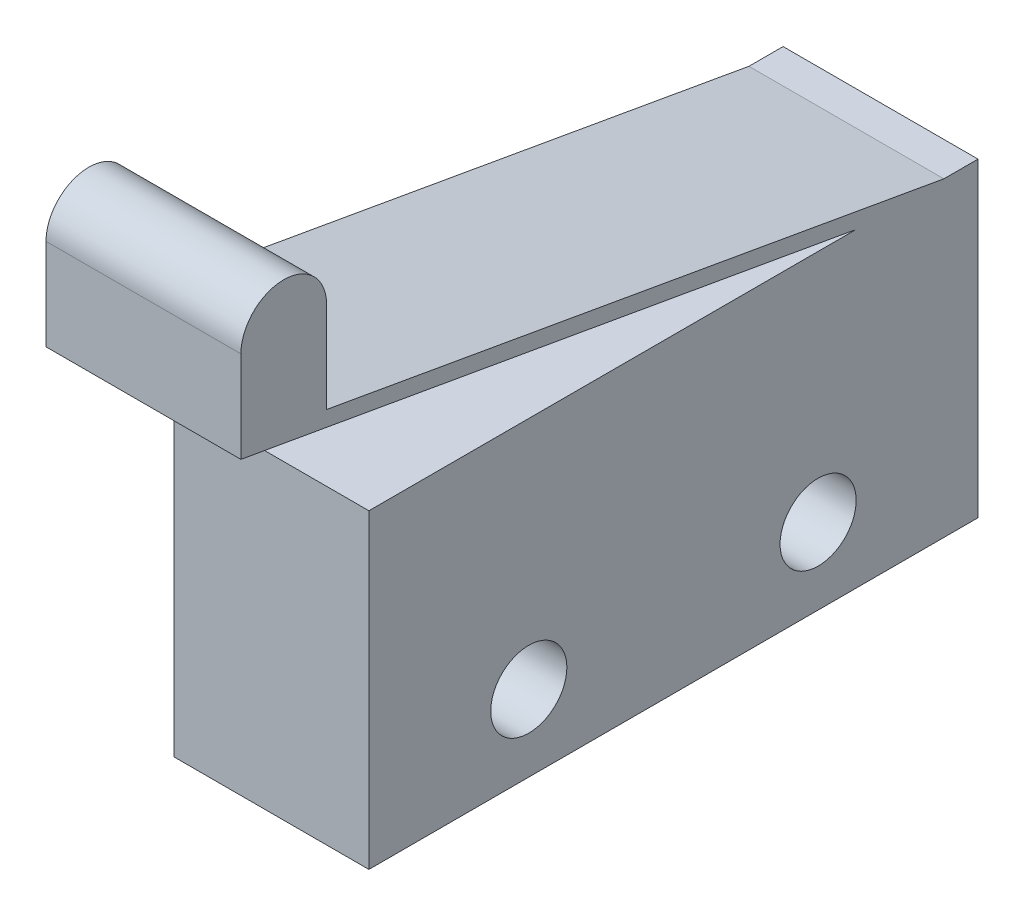
ISO-10303-21;
HEADER;
FILE_DESCRIPTION(('STEP AP214'),'2;1');
FILE_NAME('part.step','',(''),(''),'','','');
FILE_SCHEMA(('AUTOMOTIVE_DESIGN { 1 0 10303 214 1 1 1 1 }'));
ENDSEC;
DATA;
#1=APPLICATION_CONTEXT('core data for automotive mechanical design processes');
#2=APPLICATION_PROTOCOL_DEFINITION('international standard','automotive_design',2000,#1);
#3=PRODUCT_CONTEXT('',#1,'mechanical');
#4=PRODUCT('Part','Part','',(#3));
#5=PRODUCT_RELATED_PRODUCT_CATEGORY('part','',(#4));
#6=PRODUCT_DEFINITION_FORMATION('','',#4);
#7=PRODUCT_DEFINITION_CONTEXT('part definition',#1,'design');
#8=PRODUCT_DEFINITION('design','',#6,#7);
#9=PRODUCT_DEFINITION_SHAPE('','',#8);
#10=(LENGTH_UNIT() NAMED_UNIT(*) SI_UNIT(.MILLI.,.METRE.));
#11=(NAMED_UNIT(*) PLANE_ANGLE_UNIT() SI_UNIT($,.RADIAN.));
#12=(NAMED_UNIT(*) SI_UNIT($,.STERADIAN.) SOLID_ANGLE_UNIT());
#13=UNCERTAINTY_MEASURE_WITH_UNIT(LENGTH_MEASURE(1.E-05),#10,'distance_accuracy_value','');
#14=(GEOMETRIC_REPRESENTATION_CONTEXT(3) GLOBAL_UNCERTAINTY_ASSIGNED_CONTEXT((#13)) GLOBAL_UNIT_ASSIGNED_CONTEXT((#10,
#11,#12)) REPRESENTATION_CONTEXT('',''));
#15=CARTESIAN_POINT('',(0.,0.,0.));
#16=DIRECTION('',(0.,0.,1.));
#17=DIRECTION('',(1.,0.,0.));
#18=AXIS2_PLACEMENT_3D('',#15,#16,#17);
#19=CARTESIAN_POINT('',(6.4,17.5331463615789,12.7963988024724));
#20=DIRECTION('',(1.,0.,0.));
#21=DIRECTION('',(0.,0.,-1.));
#22=AXIS2_PLACEMENT_3D('',#19,#20,#21);
#23=PLANE('',#22);
#24=CARTESIAN_POINT('',(6.4,3.270845221929,4.75));
#25=DIRECTION('',(1.,0.,0.));
#26=DIRECTION('',(0.,0.,-1.));
#27=AXIS2_PLACEMENT_3D('',#24,#25,#26);
#28=CIRCLE('',#27,1.25);
#29=CARTESIAN_POINT('',(6.4,3.270845221929,3.5));
#30=VERTEX_POINT('',#29);
#31=EDGE_CURVE('E148',#30,#30,#28,.T.);
#32=ORIENTED_EDGE('',*,*,#31,.F.);
#33=EDGE_LOOP('',(#32));
#34=FACE_BOUND('',#33,.T.);
#35=DIRECTION('',(0.,-1.,0.));
#36=VECTOR('',#35,1.);
#37=CARTESIAN_POINT('',(6.4,10.970845221929,10.));
#38=LINE('',#37,#36);
#39=CARTESIAN_POINT('',(6.4,10.970845221929,10.));
#40=VERTEX_POINT('',#39);
#41=CARTESIAN_POINT('',(6.4,0.770845221928995,10.));
#42=VERTEX_POINT('',#41);
#43=EDGE_CURVE('E163',#40,#42,#38,.T.);
#44=ORIENTED_EDGE('',*,*,#43,.T.);
#45=DIRECTION('',(0.,0.,-1.));
#46=VECTOR('',#45,1.);
#47=CARTESIAN_POINT('',(6.4,0.770845221928995,10.));
#48=LINE('',#47,#46);
#49=CARTESIAN_POINT('',(6.4,0.770845221928998,-10.));
#50=VERTEX_POINT('',#49);
#51=EDGE_CURVE('E101',#42,#50,#48,.T.);
#52=ORIENTED_EDGE('',*,*,#51,.T.);
#53=DIRECTION('',(0.,1.,0.));
#54=VECTOR('',#53,1.);
#55=CARTESIAN_POINT('',(6.4,10.970845221929,-10.));
#56=LINE('',#55,#54);
#57=CARTESIAN_POINT('',(6.4,10.970845221929,-10.));
#58=VERTEX_POINT('',#57);
#59=EDGE_CURVE('E184',#50,#58,#56,.T.);
#60=ORIENTED_EDGE('',*,*,#59,.T.);
#61=DIRECTION('',(0.,0.,1.));
#62=VECTOR('',#61,1.);
#63=CARTESIAN_POINT('',(6.4,10.970845221929,-8.87938524157181));
#64=LINE('',#63,#62);
#65=CARTESIAN_POINT('',(6.4,10.970845221929,-8.87938524157181));
#66=VERTEX_POINT('',#65);
#67=EDGE_CURVE('E203',#58,#66,#64,.T.);
#68=ORIENTED_EDGE('',*,*,#67,.T.);
#69=DIRECTION('',(0.,0.173648177666931,0.984807753012208));
#70=VECTOR('',#69,1.);
#71=CARTESIAN_POINT('',(6.4,10.970845221929,-8.87938524157181));
#72=LINE('',#71,#70);
#73=CARTESIAN_POINT('',(6.4,14.5448818862863,11.3899839156448));
#74=VERTEX_POINT('',#73);
#75=EDGE_CURVE('E200',#66,#74,#72,.T.);
#76=ORIENTED_EDGE('',*,*,#75,.T.);
#77=DIRECTION('',(0.,1.,0.));
#78=VECTOR('',#77,1.);
#79=CARTESIAN_POINT('',(6.4,14.5448818862863,11.3899839156448));
#80=LINE('',#79,#78);
#81=CARTESIAN_POINT('',(6.4,17.5331463615789,11.3899839156448));
#82=VERTEX_POINT('',#81);
#83=EDGE_CURVE('E202',#74,#82,#80,.T.);
#84=ORIENTED_EDGE('',*,*,#83,.T.);
#85=CARTESIAN_POINT('',(6.4,17.5331463615789,12.7963988024724));
#86=DIRECTION('',(1.,0.,0.));
#87=DIRECTION('',(0.,0.,-1.));
#88=AXIS2_PLACEMENT_3D('',#85,#86,#87);
#89=CIRCLE('',#88,1.40641488682769);
#90=CARTESIAN_POINT('',(6.4,17.5331463615789,14.2028136893001));
#91=VERTEX_POINT('',#90);
#92=EDGE_CURVE('E126',#82,#91,#89,.T.);
#93=ORIENTED_EDGE('',*,*,#92,.T.);
#94=DIRECTION('',(0.,-1.,0.));
#95=VECTOR('',#94,1.);
#96=CARTESIAN_POINT('',(6.4,17.5331463615789,14.2028136893001));
#97=LINE('',#96,#95);
#98=CARTESIAN_POINT('',(6.4,14.5331463615789,14.2028136893001));
#99=VERTEX_POINT('',#98);
#100=EDGE_CURVE('E120',#91,#99,#97,.T.);
#101=ORIENTED_EDGE('',*,*,#100,.T.);
#102=DIRECTION('',(0.,-0.173648177666931,-0.984807753012208));
#103=VECTOR('',#102,1.);
#104=CARTESIAN_POINT('',(6.4,14.5331463615789,14.2028136893001));
#105=LINE('',#104,#103);
#106=CARTESIAN_POINT('',(6.4,10.970845221929,-6.));
#107=VERTEX_POINT('',#106);
#108=EDGE_CURVE('E124',#99,#107,#105,.T.);
#109=ORIENTED_EDGE('',*,*,#108,.T.);
#110=DIRECTION('',(0.,0.,1.));
#111=VECTOR('',#110,1.);
#112=CARTESIAN_POINT('',(6.4,10.970845221929,10.));
#113=LINE('',#112,#111);
#114=EDGE_CURVE('E52',#107,#40,#113,.T.);
#115=ORIENTED_EDGE('',*,*,#114,.T.);
#116=EDGE_LOOP('',(#44,#52,#60,#68,#76,#84,#93,#101,#109,#115));
#117=FACE_BOUND('',#116,.T.);
#118=CARTESIAN_POINT('',(6.4,3.27084522192899,-4.75));
#119=DIRECTION('',(1.,0.,0.));
#120=DIRECTION('',(0.,0.,1.));
#121=AXIS2_PLACEMENT_3D('',#118,#119,#120);
#122=CIRCLE('',#121,1.25);
#123=CARTESIAN_POINT('',(6.4,3.27084522192899,-3.5));
#124=VERTEX_POINT('',#123);
#125=EDGE_CURVE('E214',#124,#124,#122,.T.);
#126=ORIENTED_EDGE('',*,*,#125,.F.);
#127=EDGE_LOOP('',(#126));
#128=FACE_BOUND('',#127,.T.);
#129=ADVANCED_FACE('F35',(#34,#117,#128),#23,.T.);
#130=CARTESIAN_POINT('',(0.,17.5331463615789,12.7963988024724));
#131=DIRECTION('',(1.,0.,0.));
#132=DIRECTION('',(0.,0.,-1.));
#133=AXIS2_PLACEMENT_3D('',#130,#131,#132);
#134=PLANE('',#133);
#135=DIRECTION('',(0.,-1.,0.));
#136=VECTOR('',#135,1.);
#137=CARTESIAN_POINT('',(0.,10.970845221929,10.));
#138=LINE('',#137,#136);
#139=CARTESIAN_POINT('',(0.,10.970845221929,10.));
#140=VERTEX_POINT('',#139);
#141=CARTESIAN_POINT('',(0.,0.770845221928995,10.));
#142=VERTEX_POINT('',#141);
#143=EDGE_CURVE('E144',#140,#142,#138,.T.);
#144=ORIENTED_EDGE('',*,*,#143,.F.);
#145=DIRECTION('',(0.,0.,1.));
#146=VECTOR('',#145,1.);
#147=CARTESIAN_POINT('',(0.,10.970845221929,10.));
#148=LINE('',#147,#146);
#149=CARTESIAN_POINT('',(0.,10.970845221929,-6.));
#150=VERTEX_POINT('',#149);
#151=EDGE_CURVE('E93',#150,#140,#148,.T.);
#152=ORIENTED_EDGE('',*,*,#151,.F.);
#153=DIRECTION('',(0.,-0.173648177666931,-0.984807753012208));
#154=VECTOR('',#153,1.);
#155=CARTESIAN_POINT('',(0.,14.5331463615789,14.2028136893001));
#156=LINE('',#155,#154);
#157=CARTESIAN_POINT('',(0.,14.5331463615789,14.2028136893001));
#158=VERTEX_POINT('',#157);
#159=EDGE_CURVE('E87',#158,#150,#156,.T.);
#160=ORIENTED_EDGE('',*,*,#159,.F.);
#161=DIRECTION('',(0.,-1.,0.));
#162=VECTOR('',#161,1.);
#163=CARTESIAN_POINT('',(0.,17.5331463615789,14.2028136893001));
#164=LINE('',#163,#162);
#165=CARTESIAN_POINT('',(0.,17.5331463615789,14.2028136893001));
#166=VERTEX_POINT('',#165);
#167=EDGE_CURVE('E134',#166,#158,#164,.T.);
#168=ORIENTED_EDGE('',*,*,#167,.F.);
#169=CARTESIAN_POINT('',(0.,17.5331463615789,12.7963988024724));
#170=DIRECTION('',(1.,0.,0.));
#171=DIRECTION('',(0.,0.,-1.));
#172=AXIS2_PLACEMENT_3D('',#169,#170,#171);
#173=CIRCLE('',#172,1.40641488682769);
#174=CARTESIAN_POINT('',(0.,17.5331463615789,11.3899839156448));
#175=VERTEX_POINT('',#174);
#176=EDGE_CURVE('E158',#175,#166,#173,.T.);
#177=ORIENTED_EDGE('',*,*,#176,.F.);
#178=DIRECTION('',(0.,1.,0.));
#179=VECTOR('',#178,1.);
#180=CARTESIAN_POINT('',(0.,14.5448818862863,11.3899839156448));
#181=LINE('',#180,#179);
#182=CARTESIAN_POINT('',(0.,14.5448818862863,11.3899839156448));
#183=VERTEX_POINT('',#182);
#184=EDGE_CURVE('E156',#183,#175,#181,.T.);
#185=ORIENTED_EDGE('',*,*,#184,.F.);
#186=DIRECTION('',(0.,0.173648177666931,0.984807753012208));
#187=VECTOR('',#186,1.);
#188=CARTESIAN_POINT('',(0.,10.970845221929,-8.87938524157181));
#189=LINE('',#188,#187);
#190=CARTESIAN_POINT('',(0.,10.970845221929,-8.87938524157181));
#191=VERTEX_POINT('',#190);
#192=EDGE_CURVE('E154',#191,#183,#189,.T.);
#193=ORIENTED_EDGE('',*,*,#192,.F.);
#194=DIRECTION('',(0.,0.,1.));
#195=VECTOR('',#194,1.);
#196=CARTESIAN_POINT('',(0.,10.970845221929,-8.87938524157181));
#197=LINE('',#196,#195);
#198=CARTESIAN_POINT('',(0.,10.970845221929,-10.));
#199=VERTEX_POINT('',#198);
#200=EDGE_CURVE('E152',#199,#191,#197,.T.);
#201=ORIENTED_EDGE('',*,*,#200,.F.);
#202=DIRECTION('',(0.,1.,0.));
#203=VECTOR('',#202,1.);
#204=CARTESIAN_POINT('',(0.,10.970845221929,-10.));
#205=LINE('',#204,#203);
#206=CARTESIAN_POINT('',(0.,0.770845221928998,-10.));
#207=VERTEX_POINT('',#206);
#208=EDGE_CURVE('E150',#207,#199,#205,.T.);
#209=ORIENTED_EDGE('',*,*,#208,.F.);
#210=DIRECTION('',(0.,0.,-1.));
#211=VECTOR('',#210,1.);
#212=CARTESIAN_POINT('',(0.,0.770845221928995,10.));
#213=LINE('',#212,#211);
#214=EDGE_CURVE('E147',#142,#207,#213,.T.);
#215=ORIENTED_EDGE('',*,*,#214,.F.);
#216=EDGE_LOOP('',(#144,#152,#160,#168,#177,#185,#193,#201,#209,#215));
#217=FACE_BOUND('',#216,.T.);
#218=CARTESIAN_POINT('',(0.,3.270845221929,4.75));
#219=DIRECTION('',(1.,0.,0.));
#220=DIRECTION('',(0.,0.,-1.));
#221=AXIS2_PLACEMENT_3D('',#218,#219,#220);
#222=CIRCLE('',#221,1.25);
#223=CARTESIAN_POINT('',(0.,3.270845221929,3.5));
#224=VERTEX_POINT('',#223);
#225=EDGE_CURVE('E211',#224,#224,#222,.T.);
#226=ORIENTED_EDGE('',*,*,#225,.T.);
#227=EDGE_LOOP('',(#226));
#228=FACE_BOUND('',#227,.T.);
#229=CARTESIAN_POINT('',(0.,3.27084522192899,-4.75));
#230=DIRECTION('',(1.,0.,0.));
#231=DIRECTION('',(0.,0.,1.));
#232=AXIS2_PLACEMENT_3D('',#229,#230,#231);
#233=CIRCLE('',#232,1.25);
#234=CARTESIAN_POINT('',(0.,3.27084522192899,-3.5));
#235=VERTEX_POINT('',#234);
#236=EDGE_CURVE('E217',#235,#235,#233,.T.);
#237=ORIENTED_EDGE('',*,*,#236,.T.);
#238=EDGE_LOOP('',(#237));
#239=FACE_BOUND('',#238,.T.);
#240=ADVANCED_FACE('F188',(#217,#228,#239),#134,.F.);
#241=CARTESIAN_POINT('',(6.4,10.970845221929,10.));
#242=DIRECTION('',(0.,0.,-1.));
#243=DIRECTION('',(-1.,0.,0.));
#244=AXIS2_PLACEMENT_3D('',#241,#242,#243);
#245=PLANE('',#244);
#246=ORIENTED_EDGE('',*,*,#143,.T.);
#247=DIRECTION('',(-1.,0.,0.));
#248=VECTOR('',#247,1.);
#249=CARTESIAN_POINT('',(6.4,0.770845221928995,10.));
#250=LINE('',#249,#248);
#251=EDGE_CURVE('E11',#42,#142,#250,.T.);
#252=ORIENTED_EDGE('',*,*,#251,.F.);
#253=ORIENTED_EDGE('',*,*,#43,.F.);
#254=DIRECTION('',(-1.,0.,0.));
#255=VECTOR('',#254,1.);
#256=CARTESIAN_POINT('',(6.4,10.970845221929,10.));
#257=LINE('',#256,#255);
#258=EDGE_CURVE('E140',#40,#140,#257,.T.);
#259=ORIENTED_EDGE('',*,*,#258,.T.);
#260=EDGE_LOOP('',(#246,#252,#253,#259));
#261=FACE_BOUND('',#260,.T.);
#262=ADVANCED_FACE('F37',(#261),#245,.F.);
#263=CARTESIAN_POINT('',(6.4,0.770845221928995,10.));
#264=DIRECTION('',(0.,1.,0.));
#265=DIRECTION('',(0.,0.,1.));
#266=AXIS2_PLACEMENT_3D('',#263,#264,#265);
#267=PLANE('',#266);
#268=ORIENTED_EDGE('',*,*,#214,.T.);
#269=DIRECTION('',(-1.,0.,0.));
#270=VECTOR('',#269,1.);
#271=CARTESIAN_POINT('',(6.4,0.770845221928998,-10.));
#272=LINE('',#271,#270);
#273=EDGE_CURVE('E44',#50,#207,#272,.T.);
#274=ORIENTED_EDGE('',*,*,#273,.F.);
#275=ORIENTED_EDGE('',*,*,#51,.F.);
#276=ORIENTED_EDGE('',*,*,#251,.T.);
#277=EDGE_LOOP('',(#268,#274,#275,#276));
#278=FACE_BOUND('',#277,.T.);
#279=ADVANCED_FACE('F257',(#278),#267,.F.);
#280=CARTESIAN_POINT('',(6.4,10.970845221929,-10.));
#281=DIRECTION('',(0.,0.,1.));
#282=DIRECTION('',(0.,-1.,0.));
#283=AXIS2_PLACEMENT_3D('',#280,#281,#282);
#284=PLANE('',#283);
#285=ORIENTED_EDGE('',*,*,#208,.T.);
#286=DIRECTION('',(-1.,0.,0.));
#287=VECTOR('',#286,1.);
#288=CARTESIAN_POINT('',(6.4,10.970845221929,-10.));
#289=LINE('',#288,#287);
#290=EDGE_CURVE('E176',#58,#199,#289,.T.);
#291=ORIENTED_EDGE('',*,*,#290,.F.);
#292=ORIENTED_EDGE('',*,*,#59,.F.);
#293=ORIENTED_EDGE('',*,*,#273,.T.);
#294=EDGE_LOOP('',(#285,#291,#292,#293));
#295=FACE_BOUND('',#294,.T.);
#296=ADVANCED_FACE('F182',(#295),#284,.F.);
#297=CARTESIAN_POINT('',(6.4,10.970845221929,-8.87938524157181));
#298=DIRECTION('',(0.,-1.,0.));
#299=DIRECTION('',(0.,0.,-1.));
#300=AXIS2_PLACEMENT_3D('',#297,#298,#299);
#301=PLANE('',#300);
#302=ORIENTED_EDGE('',*,*,#200,.T.);
#303=DIRECTION('',(-1.,0.,0.));
#304=VECTOR('',#303,1.);
#305=CARTESIAN_POINT('',(6.4,10.970845221929,-8.87938524157181));
#306=LINE('',#305,#304);
#307=EDGE_CURVE('E173',#66,#191,#306,.T.);
#308=ORIENTED_EDGE('',*,*,#307,.F.);
#309=ORIENTED_EDGE('',*,*,#67,.F.);
#310=ORIENTED_EDGE('',*,*,#290,.T.);
#311=EDGE_LOOP('',(#302,#308,#309,#310));
#312=FACE_BOUND('',#311,.T.);
#313=ADVANCED_FACE('F194',(#312),#301,.F.);
#314=CARTESIAN_POINT('',(6.4,10.970845221929,-8.87938524157181));
#315=DIRECTION('',(0.,-0.984807753012208,0.173648177666931));
#316=DIRECTION('',(0.,-0.173648177666931,-0.984807753012208));
#317=AXIS2_PLACEMENT_3D('',#314,#315,#316);
#318=PLANE('',#317);
#319=ORIENTED_EDGE('',*,*,#192,.T.);
#320=DIRECTION('',(-1.,0.,0.));
#321=VECTOR('',#320,1.);
#322=CARTESIAN_POINT('',(6.4,14.5448818862863,11.3899839156448));
#323=LINE('',#322,#321);
#324=EDGE_CURVE('E170',#74,#183,#323,.T.);
#325=ORIENTED_EDGE('',*,*,#324,.F.);
#326=ORIENTED_EDGE('',*,*,#75,.F.);
#327=ORIENTED_EDGE('',*,*,#307,.T.);
#328=EDGE_LOOP('',(#319,#325,#326,#327));
#329=FACE_BOUND('',#328,.T.);
#330=ADVANCED_FACE('F198',(#329),#318,.F.);
#331=CARTESIAN_POINT('',(6.4,14.5448818862863,11.3899839156448));
#332=DIRECTION('',(0.,0.,1.));
#333=DIRECTION('',(1.,0.,0.));
#334=AXIS2_PLACEMENT_3D('',#331,#332,#333);
#335=PLANE('',#334);
#336=ORIENTED_EDGE('',*,*,#184,.T.);
#337=DIRECTION('',(-1.,0.,0.));
#338=VECTOR('',#337,1.);
#339=CARTESIAN_POINT('',(6.4,17.5331463615789,11.3899839156448));
#340=LINE('',#339,#338);
#341=EDGE_CURVE('E167',#82,#175,#340,.T.);
#342=ORIENTED_EDGE('',*,*,#341,.F.);
#343=ORIENTED_EDGE('',*,*,#83,.F.);
#344=ORIENTED_EDGE('',*,*,#324,.T.);
#345=EDGE_LOOP('',(#336,#342,#343,#344));
#346=FACE_BOUND('',#345,.T.);
#347=ADVANCED_FACE('F247',(#346),#335,.F.);
#348=CARTESIAN_POINT('',(6.4,17.5331463615789,12.7963988024724));
#349=DIRECTION('',(-1.,0.,0.));
#350=DIRECTION('',(0.,0.,1.));
#351=AXIS2_PLACEMENT_3D('',#348,#349,#350);
#352=CYLINDRICAL_SURFACE('',#351,1.40641488682769);
#353=ORIENTED_EDGE('',*,*,#176,.T.);
#354=DIRECTION('',(-1.,0.,0.));
#355=VECTOR('',#354,1.);
#356=CARTESIAN_POINT('',(6.4,17.5331463615789,14.2028136893001));
#357=LINE('',#356,#355);
#358=EDGE_CURVE('E135',#91,#166,#357,.T.);
#359=ORIENTED_EDGE('',*,*,#358,.F.);
#360=ORIENTED_EDGE('',*,*,#92,.F.);
#361=ORIENTED_EDGE('',*,*,#341,.T.);
#362=EDGE_LOOP('',(#353,#359,#360,#361));
#363=FACE_BOUND('',#362,.T.);
#364=ADVANCED_FACE('F244',(#363),#352,.T.);
#365=CARTESIAN_POINT('',(6.4,17.5331463615789,14.2028136893001));
#366=DIRECTION('',(0.,0.,-1.));
#367=DIRECTION('',(-1.,0.,0.));
#368=AXIS2_PLACEMENT_3D('',#365,#366,#367);
#369=PLANE('',#368);
#370=ORIENTED_EDGE('',*,*,#167,.T.);
#371=DIRECTION('',(-1.,0.,0.));
#372=VECTOR('',#371,1.);
#373=CARTESIAN_POINT('',(6.4,14.5331463615789,14.2028136893001));
#374=LINE('',#373,#372);
#375=EDGE_CURVE('E131',#99,#158,#374,.T.);
#376=ORIENTED_EDGE('',*,*,#375,.F.);
#377=ORIENTED_EDGE('',*,*,#100,.F.);
#378=ORIENTED_EDGE('',*,*,#358,.T.);
#379=EDGE_LOOP('',(#370,#376,#377,#378));
#380=FACE_BOUND('',#379,.T.);
#381=ADVANCED_FACE('F132',(#380),#369,.F.);
#382=CARTESIAN_POINT('',(6.4,14.5331463615789,14.2028136893001));
#383=DIRECTION('',(0.,0.984807753012208,-0.173648177666931));
#384=DIRECTION('',(0.,0.173648177666931,0.984807753012208));
#385=AXIS2_PLACEMENT_3D('',#382,#383,#384);
#386=PLANE('',#385);
#387=ORIENTED_EDGE('',*,*,#159,.T.);
#388=DIRECTION('',(-1.,0.,0.));
#389=VECTOR('',#388,1.);
#390=CARTESIAN_POINT('',(6.4,10.970845221929,-6.));
#391=LINE('',#390,#389);
#392=EDGE_CURVE('E136',#107,#150,#391,.T.);
#393=ORIENTED_EDGE('',*,*,#392,.F.);
#394=ORIENTED_EDGE('',*,*,#108,.F.);
#395=ORIENTED_EDGE('',*,*,#375,.T.);
#396=EDGE_LOOP('',(#387,#393,#394,#395));
#397=FACE_BOUND('',#396,.T.);
#398=ADVANCED_FACE('F138',(#397),#386,.F.);
#399=CARTESIAN_POINT('',(6.4,10.970845221929,10.));
#400=DIRECTION('',(0.,-1.,0.));
#401=DIRECTION('',(0.,0.,-1.));
#402=AXIS2_PLACEMENT_3D('',#399,#400,#401);
#403=PLANE('',#402);
#404=ORIENTED_EDGE('',*,*,#151,.T.);
#405=ORIENTED_EDGE('',*,*,#258,.F.);
#406=ORIENTED_EDGE('',*,*,#114,.F.);
#407=ORIENTED_EDGE('',*,*,#392,.T.);
#408=EDGE_LOOP('',(#404,#405,#406,#407));
#409=FACE_BOUND('',#408,.T.);
#410=ADVANCED_FACE('F237',(#409),#403,.F.);
#411=CARTESIAN_POINT('',(6.4,3.270845221929,4.75));
#412=DIRECTION('',(-1.,0.,0.));
#413=DIRECTION('',(0.,0.,1.));
#414=AXIS2_PLACEMENT_3D('',#411,#412,#413);
#415=CYLINDRICAL_SURFACE('',#414,1.25);
#416=ORIENTED_EDGE('',*,*,#31,.T.);
#417=EDGE_LOOP('',(#416));
#418=FACE_BOUND('',#417,.T.);
#419=ORIENTED_EDGE('',*,*,#225,.F.);
#420=EDGE_LOOP('',(#419));
#421=FACE_BOUND('',#420,.T.);
#422=ADVANCED_FACE('F234',(#418,#421),#415,.F.);
#423=CARTESIAN_POINT('',(6.4,3.27084522192899,-4.75));
#424=DIRECTION('',(-1.,0.,0.));
#425=DIRECTION('',(0.,0.,1.));
#426=AXIS2_PLACEMENT_3D('',#423,#424,#425);
#427=CYLINDRICAL_SURFACE('',#426,1.25);
#428=ORIENTED_EDGE('',*,*,#125,.T.);
#429=EDGE_LOOP('',(#428));
#430=FACE_BOUND('',#429,.T.);
#431=ORIENTED_EDGE('',*,*,#236,.F.);
#432=EDGE_LOOP('',(#431));
#433=FACE_BOUND('',#432,.T.);
#434=ADVANCED_FACE('F223',(#430,#433),#427,.F.);
#435=CLOSED_SHELL('',(#129,#240,#262,#279,#296,#313,#330,#347,#364,#381,#398,#410,#422,#434));
#436=MANIFOLD_SOLID_BREP('B2',#435);
#437=ADVANCED_BREP_SHAPE_REPRESENTATION('',(#18,#436),#14);
#438=SHAPE_DEFINITION_REPRESENTATION(#9,#437);
ENDSEC;
END-ISO-10303-21;
